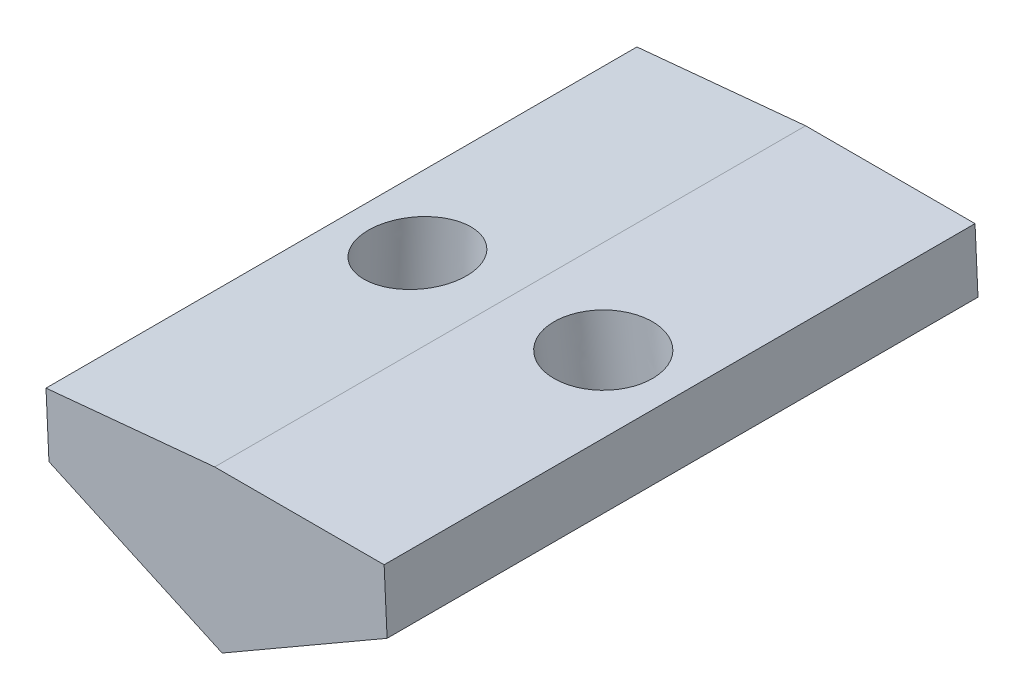
ISO-10303-21;
HEADER;
FILE_DESCRIPTION(('STEP AP214'),'2;1');
FILE_NAME('part.step','',(''),(''),'','','');
FILE_SCHEMA(('AUTOMOTIVE_DESIGN { 1 0 10303 214 1 1 1 1 }'));
ENDSEC;
DATA;
#1=APPLICATION_CONTEXT('core data for automotive mechanical design processes');
#2=APPLICATION_PROTOCOL_DEFINITION('international standard','automotive_design',2000,#1);
#3=PRODUCT_CONTEXT('',#1,'mechanical');
#4=PRODUCT('Part','Part','',(#3));
#5=PRODUCT_RELATED_PRODUCT_CATEGORY('part','',(#4));
#6=PRODUCT_DEFINITION_FORMATION('','',#4);
#7=PRODUCT_DEFINITION_CONTEXT('part definition',#1,'design');
#8=PRODUCT_DEFINITION('design','',#6,#7);
#9=PRODUCT_DEFINITION_SHAPE('','',#8);
#10=(LENGTH_UNIT() NAMED_UNIT(*) SI_UNIT(.MILLI.,.METRE.));
#11=(NAMED_UNIT(*) PLANE_ANGLE_UNIT() SI_UNIT($,.RADIAN.));
#12=(NAMED_UNIT(*) SI_UNIT($,.STERADIAN.) SOLID_ANGLE_UNIT());
#13=UNCERTAINTY_MEASURE_WITH_UNIT(LENGTH_MEASURE(1.E-05),#10,'distance_accuracy_value','');
#14=(GEOMETRIC_REPRESENTATION_CONTEXT(3) GLOBAL_UNCERTAINTY_ASSIGNED_CONTEXT((#13)) GLOBAL_UNIT_ASSIGNED_CONTEXT((#10,
#11,#12)) REPRESENTATION_CONTEXT('',''));
#15=CARTESIAN_POINT('',(0.,0.,0.));
#16=DIRECTION('',(0.,0.,1.));
#17=DIRECTION('',(1.,0.,0.));
#18=AXIS2_PLACEMENT_3D('',#15,#16,#17);
#19=CARTESIAN_POINT('',(-14.8505189803819,-1.98807355539718,7.5));
#20=DIRECTION('',(-0.415579185059123,-0.909557002581804,0.));
#21=DIRECTION('',(-0.909557002581804,0.415579185059123,0.));
#22=AXIS2_PLACEMENT_3D('',#19,#20,#21);
#23=PLANE('',#22);
#24=DIRECTION('',(0.909557002581804,-0.415579185059123,0.));
#25=VECTOR('',#24,1.);
#26=CARTESIAN_POINT('',(-14.8505189803819,-1.98807355539718,-7.5));
#27=LINE('',#26,#25);
#28=CARTESIAN_POINT('',(-14.8505189803819,-1.98807355539718,-7.5));
#29=VERTEX_POINT('',#28);
#30=CARTESIAN_POINT('',(-10.4534735725903,-3.99709612578153,-7.5));
#31=VERTEX_POINT('',#30);
#32=EDGE_CURVE('E107',#29,#31,#27,.T.);
#33=ORIENTED_EDGE('',*,*,#32,.T.);
#34=DIRECTION('',(0.,0.,-1.));
#35=VECTOR('',#34,1.);
#36=CARTESIAN_POINT('',(-10.4534735725903,-3.99709612578153,7.5));
#37=LINE('',#36,#35);
#38=CARTESIAN_POINT('',(-10.4534735725903,-3.99709612578153,7.5));
#39=VERTEX_POINT('',#38);
#40=EDGE_CURVE('E72',#39,#31,#37,.T.);
#41=ORIENTED_EDGE('',*,*,#40,.F.);
#42=DIRECTION('',(0.909557002581804,-0.415579185059123,0.));
#43=VECTOR('',#42,1.);
#44=CARTESIAN_POINT('',(-14.8505189803819,-1.98807355539718,7.5));
#45=LINE('',#44,#43);
#46=CARTESIAN_POINT('',(-14.8505189803819,-1.98807355539718,7.5));
#47=VERTEX_POINT('',#46);
#48=EDGE_CURVE('E122',#47,#39,#45,.T.);
#49=ORIENTED_EDGE('',*,*,#48,.F.);
#50=DIRECTION('',(0.,0.,-1.));
#51=VECTOR('',#50,1.);
#52=CARTESIAN_POINT('',(-14.8505189803819,-1.98807355539718,7.5));
#53=LINE('',#52,#51);
#54=EDGE_CURVE('E117',#47,#29,#53,.T.);
#55=ORIENTED_EDGE('',*,*,#54,.T.);
#56=EDGE_LOOP('',(#33,#41,#49,#55));
#57=FACE_BOUND('',#56,.T.);
#58=CARTESIAN_POINT('',(-14.289039690057,-2.24461504233912,0.));
#59=CARTESIAN_POINT('',(-14.289036375968,-2.24461655655582,0.0663782985745414));
#60=CARTESIAN_POINT('',(-14.2838261669421,-2.24699711589937,0.132821871776647));
#61=CARTESIAN_POINT('',(-14.2631677026734,-2.25643602706268,0.263798459380908));
#62=CARTESIAN_POINT('',(-14.2477113669509,-2.26349807087671,0.328329923826298));
#63=CARTESIAN_POINT('',(-14.2175080195199,-2.27729806634239,0.421777301564136));
#64=CARTESIAN_POINT('',(-14.206376599103,-2.28238404403512,0.452158199993047));
#65=CARTESIAN_POINT('',(-14.1819021127103,-2.29356650657562,0.511808067830465));
#66=CARTESIAN_POINT('',(-14.1685599961475,-2.29966255763388,0.541077507965336));
#67=CARTESIAN_POINT('',(-14.1250233400068,-2.31955457982471,0.627670823055269));
#68=CARTESIAN_POINT('',(-14.0915562404437,-2.33484579293532,0.6830491829234));
#69=CARTESIAN_POINT('',(-14.0171042904018,-2.36886310096176,0.787332027136946));
#70=CARTESIAN_POINT('',(-13.9761151281388,-2.38759116594405,0.836232770569979));
#71=CARTESIAN_POINT('',(-13.9088150211308,-2.41834077651865,0.905170853029055));
#72=CARTESIAN_POINT('',(-13.884746503528,-2.42933775076282,0.927909405199854));
#73=CARTESIAN_POINT('',(-13.835066126739,-2.45203685641628,0.971228252570491));
#74=CARTESIAN_POINT('',(-13.8094547532324,-2.46373876591716,0.991809221428911));
#75=CARTESIAN_POINT('',(-13.7299729405941,-2.50005423248987,1.05062323897325));
#76=CARTESIAN_POINT('',(-13.6739562767643,-2.52564840573911,1.08541656994461));
#77=CARTESIAN_POINT('',(-13.5577634833811,-2.57873722397352,1.14530154358398));
#78=CARTESIAN_POINT('',(-13.4975846322349,-2.60623311246224,1.17038676620097));
#79=CARTESIAN_POINT('',(-13.4024531664007,-2.64969895015318,1.20141886925401));
#80=CARTESIAN_POINT('',(-13.3684201297413,-2.66524874153501,1.21088797205526));
#81=CARTESIAN_POINT('',(-13.2998070407923,-2.69659825729805,1.22679083145963));
#82=CARTESIAN_POINT('',(-13.265227518906,-2.71239773933649,1.23322736436442));
#83=CARTESIAN_POINT('',(-13.1609386920822,-2.76004760134535,1.24796137869267));
#84=CARTESIAN_POINT('',(-13.0906503127294,-2.7921625620654,1.25169260332212));
#85=CARTESIAN_POINT('',(-12.9504521714035,-2.85621949214636,1.24689483806023));
#86=CARTESIAN_POINT('',(-12.8805424103246,-2.88816146109868,1.23836581922353));
#87=CARTESIAN_POINT('',(-12.7428300807612,-2.95108261670532,1.2091643082101));
#88=CARTESIAN_POINT('',(-12.6750276852813,-2.9820617243133,1.1884908217882));
#89=CARTESIAN_POINT('',(-12.5433598553786,-3.04222113080918,1.13528037596331));
#90=CARTESIAN_POINT('',(-12.4794950555298,-3.07140113975834,1.10274151017425));
#91=CARTESIAN_POINT('',(-12.359561885572,-3.12619894670302,1.02755882887577));
#92=CARTESIAN_POINT('',(-12.3033098873702,-3.15190064489707,0.985270183443642));
#93=CARTESIAN_POINT('',(-12.2000126492742,-3.19909744719201,0.892606887244238));
#94=CARTESIAN_POINT('',(-12.1527043640526,-3.22071273745214,0.84258798954573));
#95=CARTESIAN_POINT('',(-12.0679864678787,-3.2594205855056,0.736455551568861));
#96=CARTESIAN_POINT('',(-12.0302801504988,-3.27664870931072,0.680628738466095));
#97=CARTESIAN_POINT('',(-11.9649962416374,-3.30647711320964,0.564626374267814));
#98=CARTESIAN_POINT('',(-11.9371336190529,-3.31920762482619,0.504646660208818));
#99=CARTESIAN_POINT('',(-11.9028023867905,-3.33489366262824,0.41229613149207));
#100=CARTESIAN_POINT('',(-11.8926846979882,-3.33951646345897,0.38151589544725));
#101=CARTESIAN_POINT('',(-11.8747958584224,-3.34768992520714,0.319108263894572));
#102=CARTESIAN_POINT('',(-11.8670270073482,-3.35123953539005,0.287480070936075));
#103=CARTESIAN_POINT('',(-11.8474041821748,-3.36020526010106,0.191753738958296));
#104=CARTESIAN_POINT('',(-11.8391937167991,-3.36395664511607,0.126705863732532));
#105=CARTESIAN_POINT('',(-11.8328887894575,-3.36683738437597,-0.00396668778176826));
#106=CARTESIAN_POINT('',(-11.8347917028613,-3.36596793782198,-0.0695912100052314));
#107=CARTESIAN_POINT('',(-11.8450833051414,-3.36126567542787,-0.166480553473452));
#108=CARTESIAN_POINT('',(-11.8496896457086,-3.35916102530302,-0.198278196391107));
#109=CARTESIAN_POINT('',(-11.8612707223847,-3.35386959838476,-0.261344025826761));
#110=CARTESIAN_POINT('',(-11.8682451735034,-3.35068295180421,-0.292612275579427));
#111=CARTESIAN_POINT('',(-11.8928475975313,-3.3394420341937,-0.386116705750519));
#112=CARTESIAN_POINT('',(-11.9140688209421,-3.32974599677526,-0.447252207521547));
#113=CARTESIAN_POINT('',(-11.9652309892809,-3.30636985634293,-0.564947345862166));
#114=CARTESIAN_POINT('',(-11.9951756034567,-3.29268807683929,-0.621505044089941));
#115=CARTESIAN_POINT('',(-12.0462471684699,-3.26935333332338,-0.702573974040543));
#116=CARTESIAN_POINT('',(-12.0645638147236,-3.26098440548057,-0.729275189064333));
#117=CARTESIAN_POINT('',(-12.1030548289477,-3.24339775145197,-0.780991462976004));
#118=CARTESIAN_POINT('',(-12.1232285710982,-3.23418031120515,-0.806007085003328));
#119=CARTESIAN_POINT('',(-12.1867901406342,-3.20513884904974,-0.878887085423939));
#120=CARTESIAN_POINT('',(-12.2328425307092,-3.18409738085897,-0.92399161433926));
#121=CARTESIAN_POINT('',(-12.3306487753453,-3.13940942911517,-1.00601851486903));
#122=CARTESIAN_POINT('',(-12.3824066875117,-3.1157610916307,-1.04293500644915));
#123=CARTESIAN_POINT('',(-12.4657462934547,-3.0776829883094,-1.09322226753006));
#124=CARTESIAN_POINT('',(-12.4958230741014,-3.06394082156788,-1.10967491163987));
#125=CARTESIAN_POINT('',(-12.5570351826692,-3.03597283482031,-1.13990043394227));
#126=CARTESIAN_POINT('',(-12.5881695008624,-3.02174747616179,-1.15367578834126));
#127=CARTESIAN_POINT('',(-12.6829049098453,-2.97846259797429,-1.1909289238209));
#128=CARTESIAN_POINT('',(-12.7478669168458,-2.94878127195243,-1.21035082736061));
#129=CARTESIAN_POINT('',(-12.8796817615393,-2.88855469397997,-1.23806093139692));
#130=CARTESIAN_POINT('',(-12.9465344218122,-2.85800952309306,-1.24635017307221));
#131=CARTESIAN_POINT('',(-13.080615813133,-2.79674735351104,-1.25171887878022));
#132=CARTESIAN_POINT('',(-13.1478445339626,-2.76603035948465,-1.2487986459302));
#133=CARTESIAN_POINT('',(-13.2811259235373,-2.70513371297897,-1.23177759786365));
#134=CARTESIAN_POINT('',(-13.3471785456746,-2.67495408179486,-1.21767634055757));
#135=CARTESIAN_POINT('',(-13.4765413786905,-2.61584783494161,-1.17846290423805));
#136=CARTESIAN_POINT('',(-13.5398512982285,-2.58692135238683,-1.1533495586134));
#137=CARTESIAN_POINT('',(-13.6621031924466,-2.53106411372352,-1.09245111059459));
#138=CARTESIAN_POINT('',(-13.7210444181727,-2.50413369981421,-1.05666418361693));
#139=CARTESIAN_POINT('',(-13.8326959803471,-2.45311978305328,-0.975116357635609));
#140=CARTESIAN_POINT('',(-13.8854237827515,-2.42902829995657,-0.929384497570156));
#141=CARTESIAN_POINT('',(-13.9812795954878,-2.38523150610301,-0.830687510450994));
#142=CARTESIAN_POINT('',(-14.0246947959184,-2.36539497737205,-0.778060492778119));
#143=CARTESIAN_POINT('',(-14.1014870562068,-2.33030837492833,-0.667464474848252));
#144=CARTESIAN_POINT('',(-14.1351614830681,-2.31492243338468,-0.609745902027413));
#145=CARTESIAN_POINT('',(-14.1923601797056,-2.288788185979,-0.49066205745913));
#146=CARTESIAN_POINT('',(-14.2161523675654,-2.27791746758149,-0.429452693217399));
#147=CARTESIAN_POINT('',(-14.2526462315232,-2.26124331719822,-0.308228437378324));
#148=CARTESIAN_POINT('',(-14.2660474384406,-2.25512026758867,-0.248469937617148));
#149=CARTESIAN_POINT('',(-14.2797086947808,-2.24887840065716,-0.157013696364172));
#150=CARTESIAN_POINT('',(-14.2831902303876,-2.2472876771224,-0.125863131195248));
#151=CARTESIAN_POINT('',(-14.2878641989446,-2.24515212757638,-0.0631475549275867));
#152=CARTESIAN_POINT('',(-14.2890412668193,-2.24461432191197,-0.0315811653207291));
#153=CARTESIAN_POINT('',(-14.289039690057,-2.24461504233912,0.));
#154=B_SPLINE_CURVE_WITH_KNOTS('',3,(#58,#59,#60,#61,#62,#63,#64,#65,#66,#67,#68,#69,#70,#71,
#72,#73,#74,#75,#76,#77,#78,#79,#80,#81,#82,#83,#84,#85,#86,#87,#88,#89,#90,#91,#92,#93,#94,#95,
#96,#97,#98,#99,#100,#101,#102,#103,#104,#105,#106,#107,#108,#109,#110,#111,#112,#113,#114,#115,
#116,#117,#118,#119,#120,#121,#122,#123,#124,#125,#126,#127,#128,#129,#130,#131,#132,#133,#134,
#135,#136,#137,#138,#139,#140,#141,#142,#143,#144,#145,#146,#147,#148,#149,#150,#151,#152,#153),
.UNSPECIFIED.,.T.,.F.,(4,2,2,2,2,2,2,2,2,2,2,2,2,2,2,2,2,2,2,2,2,2,2,2,2,2,2,2,2,2,2,2,2,2,2,2,
2,2,2,2,2,2,2,2,2,2,2,4),(0.,0.199018913833737,0.398194968468036,0.496359711116183,
0.594482404357344,0.79302739484204,0.991686552476848,1.09625837626465,1.20079745191192,
1.41210542046451,1.62355289087992,1.73923038489,1.85480176999455,2.08584659927705,
2.31689197403699,2.54795626669241,2.77905770034088,3.00279249479485,3.21827549177727,
3.42594571343107,3.62698331914807,3.72507175847922,3.82325592508802,4.01927862844559,
4.21525046235212,4.31175006010901,4.40823804873484,4.60360176492279,4.79904777427686,
4.89928687351483,4.99949231612345,5.20204696800678,5.40474661184873,5.51544494054762,
5.62604039275902,5.84712556911769,6.06819006711453,6.28924858731186,6.5103158484378,
6.73140653490023,6.95253503714699,7.17302631857153,7.38519647263605,7.58996442996936,
7.78874701532292,7.97257929502029,8.06664254893988,8.16133086356538),.UNSPECIFIED.);
#155=CARTESIAN_POINT('',(-14.289039690057,-2.24461504233912,0.));
#156=VERTEX_POINT('',#155);
#157=EDGE_CURVE('E176',#156,#156,#154,.T.);
#158=ORIENTED_EDGE('',*,*,#157,.T.);
#159=EDGE_LOOP('',(#158));
#160=FACE_BOUND('',#159,.T.);
#161=ADVANCED_FACE('F38',(#57,#160),#23,.T.);
#162=CARTESIAN_POINT('',(-10.6435171949677,0.,7.5));
#163=DIRECTION('',(-0.094876369745652,0.995489062955433,0.));
#164=DIRECTION('',(0.995489062955433,0.094876369745652,0.));
#165=AXIS2_PLACEMENT_3D('',#162,#163,#164);
#166=PLANE('',#165);
#167=DIRECTION('',(-0.995489062955433,-0.094876369745652,0.));
#168=VECTOR('',#167,1.);
#169=CARTESIAN_POINT('',(-10.6435171949677,0.,-7.5));
#170=LINE('',#169,#168);
#171=CARTESIAN_POINT('',(-10.6435171949677,0.,-7.5));
#172=VERTEX_POINT('',#171);
#173=CARTESIAN_POINT('',(-14.9256460133394,-0.408113812786843,-7.5));
#174=VERTEX_POINT('',#173);
#175=EDGE_CURVE('E114',#172,#174,#170,.T.);
#176=ORIENTED_EDGE('',*,*,#175,.T.);
#177=DIRECTION('',(0.,0.,-1.));
#178=VECTOR('',#177,1.);
#179=CARTESIAN_POINT('',(-14.9256460133394,-0.408113812786843,7.5));
#180=LINE('',#179,#178);
#181=CARTESIAN_POINT('',(-14.9256460133394,-0.408113812786843,7.5));
#182=VERTEX_POINT('',#181);
#183=EDGE_CURVE('E110',#182,#174,#180,.T.);
#184=ORIENTED_EDGE('',*,*,#183,.F.);
#185=DIRECTION('',(-0.995489062955433,-0.094876369745652,0.));
#186=VECTOR('',#185,1.);
#187=CARTESIAN_POINT('',(-10.6435171949677,0.,7.5));
#188=LINE('',#187,#186);
#189=CARTESIAN_POINT('',(-10.6435171949677,0.,7.5));
#190=VERTEX_POINT('',#189);
#191=EDGE_CURVE('E98',#190,#182,#188,.T.);
#192=ORIENTED_EDGE('',*,*,#191,.F.);
#193=DIRECTION('',(0.,0.,-1.));
#194=VECTOR('',#193,1.);
#195=CARTESIAN_POINT('',(-10.6435171949677,0.,7.5));
#196=LINE('',#195,#194);
#197=EDGE_CURVE('E80',#190,#172,#196,.T.);
#198=ORIENTED_EDGE('',*,*,#197,.T.);
#199=EDGE_LOOP('',(#176,#184,#192,#198));
#200=FACE_BOUND('',#199,.T.);
#201=CARTESIAN_POINT('',(-14.2410978489657,-0.342872066625405,0.));
#202=CARTESIAN_POINT('',(-14.2410944818184,-0.342871745715087,0.0692358626819135));
#203=CARTESIAN_POINT('',(-14.2353503416949,-0.342324293028254,0.138544405837956));
#204=CARTESIAN_POINT('',(-14.2125242295172,-0.340148820951845,0.275211754098849));
#205=CARTESIAN_POINT('',(-14.1954422591119,-0.338520801719427,0.342570559487267));
#206=CARTESIAN_POINT('',(-14.1504155837906,-0.334229476324524,0.473529755417845));
#207=CARTESIAN_POINT('',(-14.1224708789307,-0.331566170167402,0.537130145979473));
#208=CARTESIAN_POINT('',(-14.0564884399864,-0.32527762867864,0.658805162167844));
#209=CARTESIAN_POINT('',(-14.0184507059757,-0.321652393354039,0.716879787835019));
#210=CARTESIAN_POINT('',(-13.9333316323066,-0.3135400101985,0.825905040356854));
#211=CARTESIAN_POINT('',(-13.8862502927263,-0.309052862375019,0.876855667273154));
#212=CARTESIAN_POINT('',(-13.7843425024721,-0.299340408920826,0.970226708469671));
#213=CARTESIAN_POINT('',(-13.7295160518683,-0.294115103296787,1.012647122827));
#214=CARTESIAN_POINT('',(-13.6136302434667,-0.283070456785506,1.08778800206828));
#215=CARTESIAN_POINT('',(-13.5525708857214,-0.277251115903278,1.12050846703407));
#216=CARTESIAN_POINT('',(-13.425903344459,-0.265178902428713,1.17534692644399));
#217=CARTESIAN_POINT('',(-13.3602951609731,-0.258926029839372,1.19746492096137));
#218=CARTESIAN_POINT('',(-13.2263395113012,-0.246159213788109,1.23048843042266));
#219=CARTESIAN_POINT('',(-13.1579920451277,-0.239645270327394,1.24139394541842));
#220=CARTESIAN_POINT('',(-13.0204429188519,-0.226535973351305,1.25169171124794));
#221=CARTESIAN_POINT('',(-12.9512412587512,-0.219940619836081,1.25108396210281));
#222=CARTESIAN_POINT('',(-12.8138923918439,-0.206850408837525,1.23837196303159));
#223=CARTESIAN_POINT('',(-12.7457451850386,-0.20035555135431,1.22626771309218));
#224=CARTESIAN_POINT('',(-12.6123847908199,-0.187645466892155,1.19089655368163));
#225=CARTESIAN_POINT('',(-12.5471716034184,-0.181430239914339,1.16762964416558));
#226=CARTESIAN_POINT('',(-12.4214778957895,-0.169450838910884,1.11057488097867));
#227=CARTESIAN_POINT('',(-12.3609973755927,-0.163686664888153,1.07678702723998));
#228=CARTESIAN_POINT('',(-12.246437124959,-0.152768352370476,0.999622268521558));
#229=CARTESIAN_POINT('',(-12.1923573945744,-0.147614213880511,0.956245363463534));
#230=CARTESIAN_POINT('',(-12.0920903123887,-0.138058130225979,0.861098873798068));
#231=CARTESIAN_POINT('',(-12.0459029606585,-0.133656185068174,0.809329289115186));
#232=CARTESIAN_POINT('',(-11.9626945494446,-0.125725900063499,0.698825296714459));
#233=CARTESIAN_POINT('',(-11.9256734900419,-0.122197560224342,0.640090888935133));
#234=CARTESIAN_POINT('',(-11.8618187628964,-0.116111803054216,0.517277211959699));
#235=CARTESIAN_POINT('',(-11.8349850952321,-0.113554385730722,0.453197942722444));
#236=CARTESIAN_POINT('',(-11.7922452712066,-0.109481011649581,0.321461933665315));
#237=CARTESIAN_POINT('',(-11.7763391142282,-0.107965054833097,0.253805194047546));
#238=CARTESIAN_POINT('',(-11.7558930330646,-0.106016414683735,0.116780330417331));
#239=CARTESIAN_POINT('',(-11.7513531045745,-0.105583730940569,0.0474122070530809));
#240=CARTESIAN_POINT('',(-11.7537646872583,-0.1058135699402,-0.0911221816600625));
#241=CARTESIAN_POINT('',(-11.7607161984342,-0.1064760926832,-0.160288447008918));
#242=CARTESIAN_POINT('',(-11.7859189252829,-0.108878071087664,-0.296511420127748));
#243=CARTESIAN_POINT('',(-11.8041701409243,-0.110617526746136,-0.363568127903583));
#244=CARTESIAN_POINT('',(-11.8514688762347,-0.115125393750205,-0.493722474367876));
#245=CARTESIAN_POINT('',(-11.8805163958449,-0.117893805090209,-0.556820113077857));
#246=CARTESIAN_POINT('',(-11.9486065604006,-0.124383226088212,-0.677316012191557));
#247=CARTESIAN_POINT('',(-11.9876492052711,-0.128104235739068,-0.734714272638012));
#248=CARTESIAN_POINT('',(-12.0746527644833,-0.13639622222107,-0.842228309051984));
#249=CARTESIAN_POINT('',(-12.1226136787471,-0.140967199044788,-0.892344085083145));
#250=CARTESIAN_POINT('',(-12.2261309483045,-0.150833046000883,-0.983910912570453));
#251=CARTESIAN_POINT('',(-12.2816873035295,-0.156127916126727,-1.02536196410478));
#252=CARTESIAN_POINT('',(-12.3988631419393,-0.167295510612614,-1.09845608982839));
#253=CARTESIAN_POINT('',(-12.4604826250736,-0.173168234967851,-1.13009916409926));
#254=CARTESIAN_POINT('',(-12.5880851858293,-0.185329561681784,-1.18270459852465));
#255=CARTESIAN_POINT('',(-12.6540682634214,-0.191618164037694,-1.20366695875074));
#256=CARTESIAN_POINT('',(-12.7885781337585,-0.204437800804629,-1.2343328115842));
#257=CARTESIAN_POINT('',(-12.8571049264925,-0.2109688352146,-1.24403630424056));
#258=CARTESIAN_POINT('',(-12.9948121938735,-0.224093204032797,-1.2519167950458));
#259=CARTESIAN_POINT('',(-13.0639926685196,-0.230686538440929,-1.25009379321224));
#260=CARTESIAN_POINT('',(-13.2010992388503,-0.243753657051585,-1.23497157381143));
#261=CARTESIAN_POINT('',(-13.269025334533,-0.250227441253933,-1.22167235622728));
#262=CARTESIAN_POINT('',(-13.4017496795478,-0.262876906225941,-1.18396450648421));
#263=CARTESIAN_POINT('',(-13.4665479288664,-0.269052586994316,-1.15955587427746));
#264=CARTESIAN_POINT('',(-13.5912293824965,-0.280935513824183,-1.10030239222836));
#265=CARTESIAN_POINT('',(-13.6511125867752,-0.286642759882553,-1.06545754231645));
#266=CARTESIAN_POINT('',(-13.7643122890411,-0.297431403582356,-0.986292697665745));
#267=CARTESIAN_POINT('',(-13.8176287869738,-0.302512801218598,-0.941972702848335));
#268=CARTESIAN_POINT('',(-13.9162245914832,-0.311909601597537,-0.845079848038767));
#269=CARTESIAN_POINT('',(-13.9615038979875,-0.316225004333327,-0.792506987972179));
#270=CARTESIAN_POINT('',(-14.0427762562685,-0.323970771314907,-0.680558797629225));
#271=CARTESIAN_POINT('',(-14.0787693079639,-0.327401135552951,-0.621183467293319));
#272=CARTESIAN_POINT('',(-14.1404771405686,-0.33328228016847,-0.497266542456667));
#273=CARTESIAN_POINT('',(-14.1661919214005,-0.33573306053857,-0.432724947917031));
#274=CARTESIAN_POINT('',(-14.204308110304,-0.339365773107975,-0.307870659100866));
#275=CARTESIAN_POINT('',(-14.217899696314,-0.340661136751533,-0.247924083108697));
#276=CARTESIAN_POINT('',(-14.231707772208,-0.341977133242857,-0.156433524947284));
#277=CARTESIAN_POINT('',(-14.235214711017,-0.342311366571471,-0.125361012415935));
#278=CARTESIAN_POINT('',(-14.2399171342818,-0.342759537088838,-0.0628646576544196));
#279=CARTESIAN_POINT('',(-14.2410993779784,-0.342872212349932,-0.0314398223443878));
#280=CARTESIAN_POINT('',(-14.2410978489657,-0.342872066625405,0.));
#281=B_SPLINE_CURVE_WITH_KNOTS('',3,(#201,#202,#203,#204,#205,#206,#207,#208,#209,#210,#211,
#212,#213,#214,#215,#216,#217,#218,#219,#220,#221,#222,#223,#224,#225,#226,#227,#228,#229,#230,
#231,#232,#233,#234,#235,#236,#237,#238,#239,#240,#241,#242,#243,#244,#245,#246,#247,#248,#249,
#250,#251,#252,#253,#254,#255,#256,#257,#258,#259,#260,#261,#262,#263,#264,#265,#266,#267,#268,
#269,#270,#271,#272,#273,#274,#275,#276,#277,#278,#279,#280),.UNSPECIFIED.,.T.,.F.,(4,2,2,2,2,2,
2,2,2,2,2,2,2,2,2,2,2,2,2,2,2,2,2,2,2,2,2,2,2,2,2,2,2,2,2,2,2,2,2,4),(0.,0.207595043011116,
0.415190055829751,0.622785067573066,0.830380077797412,1.03797508622557,1.24557009277712,
1.45316509757725,1.66076010094304,1.86835510334871,2.07595010537367,2.28354510763907,
2.49114011073969,2.69873511517879,2.90633012131302,3.11392512931328,3.32152013914604,
3.52911515057699,3.73671015028008,3.94430507135664,4.1518999924715,4.35949491300967,
4.56708983241936,4.7746847502724,4.98227966631121,5.18987458047695,5.39746949291604,
5.60506440396403,5.81265931410892,6.02025422393763,6.22784913407173,6.43544404509933,
6.64303895751065,6.85063387164431,7.05822878765021,7.26582370547314,7.47341862485881,
7.65716205990829,7.7508980576219,7.8451664182521),.UNSPECIFIED.);
#282=CARTESIAN_POINT('',(-14.2410978489657,-0.342872066625405,0.));
#283=VERTEX_POINT('',#282);
#284=EDGE_CURVE('E185',#283,#283,#281,.T.);
#285=ORIENTED_EDGE('',*,*,#284,.F.);
#286=EDGE_LOOP('',(#285));
#287=FACE_BOUND('',#286,.T.);
#288=ADVANCED_FACE('F111',(#200,#287),#166,.T.);
#289=CARTESIAN_POINT('',(-6.26687172803054,-1.57996042383524,7.5));
#290=DIRECTION('',(0.499999999999987,-0.866025403784446,0.));
#291=DIRECTION('',(0.866025403784446,0.499999999999987,0.));
#292=AXIS2_PLACEMENT_3D('',#289,#290,#291);
#293=PLANE('',#292);
#294=DIRECTION('',(-0.866025403784446,-0.499999999999987,0.));
#295=VECTOR('',#294,1.);
#296=CARTESIAN_POINT('',(-6.26687172803054,-1.57996042383524,-7.5));
#297=LINE('',#296,#295);
#298=CARTESIAN_POINT('',(-6.26687172803054,-1.57996042383524,-7.5));
#299=VERTEX_POINT('',#298);
#300=EDGE_CURVE('E139',#299,#31,#297,.T.);
#301=ORIENTED_EDGE('',*,*,#300,.F.);
#302=DIRECTION('',(0.,0.,-1.));
#303=VECTOR('',#302,1.);
#304=CARTESIAN_POINT('',(-6.26687172803054,-1.57996042383524,7.5));
#305=LINE('',#304,#303);
#306=CARTESIAN_POINT('',(-6.26687172803054,-1.57996042383524,7.5));
#307=VERTEX_POINT('',#306);
#308=EDGE_CURVE('E11',#307,#299,#305,.T.);
#309=ORIENTED_EDGE('',*,*,#308,.F.);
#310=DIRECTION('',(-0.866025403784446,-0.499999999999987,0.));
#311=VECTOR('',#310,1.);
#312=CARTESIAN_POINT('',(-6.26687172803054,-1.57996042383524,7.5));
#313=LINE('',#312,#311);
#314=EDGE_CURVE('E55',#307,#39,#313,.T.);
#315=ORIENTED_EDGE('',*,*,#314,.T.);
#316=ORIENTED_EDGE('',*,*,#40,.T.);
#317=EDGE_LOOP('',(#301,#309,#315,#316));
#318=FACE_BOUND('',#317,.T.);
#319=CARTESIAN_POINT('',(-9.13855647447668,-3.2379283852236,0.));
#320=CARTESIAN_POINT('',(-9.13855330053664,-3.23792655274846,0.0664031444598509));
#321=CARTESIAN_POINT('',(-9.13358865105196,-3.23506021103205,0.132871948839943));
#322=CARTESIAN_POINT('',(-9.11391159989156,-3.22369966024774,0.263846406433579));
#323=CARTESIAN_POINT('',(-9.09919893877027,-3.21520530138886,0.328352007348218));
#324=CARTESIAN_POINT('',(-9.07044935539053,-3.19860672168548,0.421772480975602));
#325=CARTESIAN_POINT('',(-9.05985166788161,-3.19248814394942,0.452150837413798));
#326=CARTESIAN_POINT('',(-9.03654898460056,-3.17903433348427,0.51180054912965));
#327=CARTESIAN_POINT('',(-9.02384455719461,-3.17169942890154,0.541072200370953));
#328=CARTESIAN_POINT('',(-8.98239008501426,-3.14776567822909,0.627668590552461));
#329=CARTESIAN_POINT('',(-8.95052410911981,-3.12936784846842,0.683047818143838));
#330=CARTESIAN_POINT('',(-8.87963558454408,-3.08844033972223,0.787329821835831));
#331=CARTESIAN_POINT('',(-8.84060924932574,-3.06590847457853,0.836229147563132));
#332=CARTESIAN_POINT('',(-8.77653151133897,-3.02891317530276,0.905165989293868));
#333=CARTESIAN_POINT('',(-8.7536150522447,-3.01568235147576,0.927904500930129));
#334=CARTESIAN_POINT('',(-8.70631247287795,-2.98837219454496,0.971223481571515));
#335=CARTESIAN_POINT('',(-8.68192680258792,-2.97429312123866,0.991804606092093));
#336=CARTESIAN_POINT('',(-8.60624898147913,-2.93060051084983,1.05061895707605));
#337=CARTESIAN_POINT('',(-8.55291333257692,-2.89980715959872,1.08541249614508));
#338=CARTESIAN_POINT('',(-8.44228175580297,-2.83593398896743,1.14529792032574));
#339=CARTESIAN_POINT('',(-8.38498324442137,-2.80285267799713,1.1703834048337));
#340=CARTESIAN_POINT('',(-8.29440470495491,-2.75055713385335,1.20141615259024));
#341=CARTESIAN_POINT('',(-8.262000240305,-2.73184840746476,1.21088555020413));
#342=CARTESIAN_POINT('',(-8.19667044874199,-2.69413023471974,1.22678898832562));
#343=CARTESIAN_POINT('',(-8.16374562670446,-2.67512107985336,1.23322580427392));
#344=CARTESIAN_POINT('',(-8.06444721894711,-2.61779111740456,1.24796064678936));
#345=CARTESIAN_POINT('',(-7.99752224751999,-2.57915196713561,1.25169239913987));
#346=CARTESIAN_POINT('',(-7.86403273067881,-2.50208175865336,1.24689563967948));
#347=CARTESIAN_POINT('',(-7.79746818611492,-2.46365070093091,1.23836709896152));
#348=CARTESIAN_POINT('',(-7.66634536557355,-2.38794690519445,1.20916647610518));
#349=CARTESIAN_POINT('',(-7.60178725432217,-2.3506742622851,1.18849339967129));
#350=CARTESIAN_POINT('',(-7.47641950171939,-2.27829315657217,1.13528366987424));
#351=CARTESIAN_POINT('',(-7.41561046460321,-2.24318504262398,1.10274510997378));
#352=CARTESIAN_POINT('',(-7.3014157022866,-2.17725466586041,1.02756290519838));
#353=CARTESIAN_POINT('',(-7.24785513541873,-2.14633145816129,0.985274442023723));
#354=CARTESIAN_POINT('',(-7.14950032496257,-2.08954628186831,0.892611499181224));
#355=CARTESIAN_POINT('',(-7.10445560206486,-2.06353969897774,0.842592812336494));
#356=CARTESIAN_POINT('',(-7.02379123714336,-2.01696810617631,0.736460844283201));
#357=CARTESIAN_POINT('',(-6.98788906238688,-1.99623997591616,0.680634322609165));
#358=CARTESIAN_POINT('',(-6.92572877251105,-1.96035171582345,0.564632615233623));
#359=CARTESIAN_POINT('',(-6.89919924149592,-1.94503488395039,0.504653289592588));
#360=CARTESIAN_POINT('',(-6.86651048740321,-1.92616202297554,0.412303352557294));
#361=CARTESIAN_POINT('',(-6.8568768388574,-1.92060003339436,0.381523357969075));
#362=CARTESIAN_POINT('',(-6.83984375703489,-1.91076597901902,0.319116190076079));
#363=CARTESIAN_POINT('',(-6.83244651336963,-1.9064951783976,0.287488219300865));
#364=CARTESIAN_POINT('',(-6.81376221130775,-1.89570779157253,0.191762641639723));
#365=CARTESIAN_POINT('',(-6.80594424546576,-1.89119408688917,0.126715270755784));
#366=CARTESIAN_POINT('',(-6.79994010339946,-1.88772759385096,-0.0039563680682391));
#367=CARTESIAN_POINT('',(-6.80175142806,-1.8887733626313,-0.0695804819110402));
#368=CARTESIAN_POINT('',(-6.81154967206118,-1.89443038144297,-0.166469278072372));
#369=CARTESIAN_POINT('',(-6.81593528125897,-1.89696241409388,-0.198266743080782));
#370=CARTESIAN_POINT('',(-6.82696153240195,-1.90332842315942,-0.261332242650706));
#371=CARTESIAN_POINT('',(-6.83360190298223,-1.90716224290144,-0.292600340447386));
#372=CARTESIAN_POINT('',(-6.85702598108138,-1.92068614069759,-0.386104348124554));
#373=CARTESIAN_POINT('',(-6.87723094914467,-1.93235148444815,-0.447239621354218));
#374=CARTESIAN_POINT('',(-6.92594324117862,-1.96047553936617,-0.564934427799638));
#375=CARTESIAN_POINT('',(-6.95445405900469,-1.97693626771199,-0.621492022595375));
#376=CARTESIAN_POINT('',(-7.00308036324736,-2.0050106775567,-0.702560955042495));
#377=CARTESIAN_POINT('',(-7.02052006270558,-2.01507949273399,-0.729262220051415));
#378=CARTESIAN_POINT('',(-7.05716826990814,-2.03623834502807,-0.780978627930369));
#379=CARTESIAN_POINT('',(-7.07637618174161,-2.04732803809557,-0.805994333969206));
#380=CARTESIAN_POINT('',(-7.1368947299108,-2.08226843817182,-0.87887463448846));
#381=CARTESIAN_POINT('',(-7.18074239723741,-2.10758390070628,-0.923979438954056));
#382=CARTESIAN_POINT('',(-7.2738663234323,-2.16134902456295,-1.00600707767065));
#383=CARTESIAN_POINT('',(-7.32314644590026,-2.18980091653548,-1.0429240317266));
#384=CARTESIAN_POINT('',(-7.40249666597163,-2.23561378745394,-1.09321232669005));
#385=CARTESIAN_POINT('',(-7.43113387764338,-2.25214748932148,-1.10966544471788));
#386=CARTESIAN_POINT('',(-7.48941621408364,-2.28579681195427,-1.13989193450968));
#387=CARTESIAN_POINT('',(-7.51906037742988,-2.30291187764212,-1.15366778244676));
#388=CARTESIAN_POINT('',(-7.60926159148189,-2.35498957285628,-1.19092243157543));
#389=CARTESIAN_POINT('',(-7.67111446644475,-2.39070034686623,-1.21034538915434));
#390=CARTESIAN_POINT('',(-7.79662067913867,-2.46316139255004,-1.23805770090527));
#391=CARTESIAN_POINT('',(-7.86027384790556,-2.49991156667237,-1.24634809639178));
#392=CARTESIAN_POINT('',(-7.98793841050431,-2.57361873625473,-1.25171920832629));
#393=CARTESIAN_POINT('',(-8.05194979459966,-2.61057572609338,-1.2488002279884));
#394=CARTESIAN_POINT('',(-8.17885298095899,-2.68384331489895,-1.23178176507942));
#395=CARTESIAN_POINT('',(-8.24174473885878,-2.72015388825221,-1.21768184047718));
#396=CARTESIAN_POINT('',(-8.36491731026563,-2.79126760551073,-1.17847111143459));
#397=CARTESIAN_POINT('',(-8.42519784639996,-2.82607058927479,-1.15335914039386));
#398=CARTESIAN_POINT('',(-8.54160026073016,-2.89327555452266,-1.09246342460029));
#399=CARTESIAN_POINT('',(-8.59772142583692,-2.92567712430428,-1.05667785520851));
#400=CARTESIAN_POINT('',(-8.7040317246939,-2.98705540396701,-0.975132332052509));
#401=CARTESIAN_POINT('',(-8.75423744380631,-3.01604168941144,-0.929401340721442));
#402=CARTESIAN_POINT('',(-8.84550839373026,-3.06873699691925,-0.830705938328169));
#403=CARTESIAN_POINT('',(-8.88684709356303,-3.09260390639565,-0.778079682238342));
#404=CARTESIAN_POINT('',(-8.95996666739991,-3.13481951203339,-0.667485099683322));
#405=CARTESIAN_POINT('',(-8.99203070401641,-3.15333169220522,-0.609767237069987));
#406=CARTESIAN_POINT('',(-9.04649433944926,-3.18477628678341,-0.490684720671005));
#407=CARTESIAN_POINT('',(-9.06914906325893,-3.19785599767333,-0.429476002246919));
#408=CARTESIAN_POINT('',(-9.10389986620439,-3.21791938310842,-0.308248975885651));
#409=CARTESIAN_POINT('',(-9.1166614690312,-3.22528729793576,-0.248486868980305));
#410=CARTESIAN_POINT('',(-9.12968324700305,-3.23280542495312,-0.156936753890962));
#411=CARTESIAN_POINT('',(-9.13300495117986,-3.23472321175377,-0.12569509237541));
#412=CARTESIAN_POINT('',(-9.13744339320966,-3.23728574745446,-0.0629740119896809));
#413=CARTESIAN_POINT('',(-9.13855797984679,-3.23792925434944,-0.0314943911478631));
#414=CARTESIAN_POINT('',(-9.13855647447668,-3.2379283852236,0.));
#415=B_SPLINE_CURVE_WITH_KNOTS('',3,(#319,#320,#321,#322,#323,#324,#325,#326,#327,#328,#329,
#330,#331,#332,#333,#334,#335,#336,#337,#338,#339,#340,#341,#342,#343,#344,#345,#346,#347,#348,
#349,#350,#351,#352,#353,#354,#355,#356,#357,#358,#359,#360,#361,#362,#363,#364,#365,#366,#367,
#368,#369,#370,#371,#372,#373,#374,#375,#376,#377,#378,#379,#380,#381,#382,#383,#384,#385,#386,
#387,#388,#389,#390,#391,#392,#393,#394,#395,#396,#397,#398,#399,#400,#401,#402,#403,#404,#405,
#406,#407,#408,#409,#410,#411,#412,#413,#414),.UNSPECIFIED.,.T.,.F.,(4,2,2,2,2,2,2,2,2,2,2,2,2,
2,2,2,2,2,2,2,2,2,2,2,2,2,2,2,2,2,2,2,2,2,2,2,2,2,2,2,2,2,2,2,2,2,2,4),(0.,0.199093737732046,
0.398192774602408,0.496349165582242,0.594479118424647,0.793027406656067,0.991680995296886,
1.09625238836964,1.20079191507859,1.41210006621055,1.62354729823297,1.73922587042434,
1.85479836609532,2.08584538128788,2.31689294123914,2.54795942011645,2.77906304295972,
3.00279981219163,3.21828392062462,3.42595445130437,3.62699168229002,3.72507966990448,
3.82326338445267,4.01928481254398,4.21525536916134,4.31175429283746,4.4082416067945,
4.60360394546016,4.79904858224151,4.89928715976825,4.99949207839049,5.20204562779791,
5.40474417560819,5.51544286628037,5.62603868073976,5.84712457843266,6.06818979481343,
6.28924903141232,6.51031700787593,6.73140840962318,6.95253762836581,7.17303131156584,
7.38520292938897,7.58997149256335,7.78875391459155,7.97259826535742,8.06693466355032,
8.16136296362894),.UNSPECIFIED.);
#416=CARTESIAN_POINT('',(-9.13855647447668,-3.2379283852236,0.));
#417=VERTEX_POINT('',#416);
#418=EDGE_CURVE('E129',#417,#417,#415,.T.);
#419=ORIENTED_EDGE('',*,*,#418,.T.);
#420=EDGE_LOOP('',(#419));
#421=FACE_BOUND('',#420,.T.);
#422=ADVANCED_FACE('F161',(#318,#421),#293,.T.);
#423=CARTESIAN_POINT('',(-10.6435171949677,0.,7.5));
#424=DIRECTION('',(0.,1.,0.));
#425=DIRECTION('',(-1.,0.,0.));
#426=AXIS2_PLACEMENT_3D('',#423,#424,#425);
#427=PLANE('',#426);
#428=DIRECTION('',(1.,0.,0.));
#429=VECTOR('',#428,1.);
#430=CARTESIAN_POINT('',(-10.6435171949677,0.,-7.5));
#431=LINE('',#430,#429);
#432=CARTESIAN_POINT('',(-6.34198443311221,0.,-7.5));
#433=VERTEX_POINT('',#432);
#434=EDGE_CURVE('E134',#172,#433,#431,.T.);
#435=ORIENTED_EDGE('',*,*,#434,.F.);
#436=ORIENTED_EDGE('',*,*,#197,.F.);
#437=DIRECTION('',(1.,0.,0.));
#438=VECTOR('',#437,1.);
#439=CARTESIAN_POINT('',(-10.6435171949677,0.,7.5));
#440=LINE('',#439,#438);
#441=CARTESIAN_POINT('',(-6.34198443311221,0.,7.5));
#442=VERTEX_POINT('',#441);
#443=EDGE_CURVE('E105',#190,#442,#440,.T.);
#444=ORIENTED_EDGE('',*,*,#443,.T.);
#445=DIRECTION('',(0.,0.,-1.));
#446=VECTOR('',#445,1.);
#447=CARTESIAN_POINT('',(-6.34198443311221,0.,7.5));
#448=LINE('',#447,#446);
#449=EDGE_CURVE('E42',#442,#433,#448,.T.);
#450=ORIENTED_EDGE('',*,*,#449,.T.);
#451=EDGE_LOOP('',(#435,#436,#444,#450));
#452=FACE_BOUND('',#451,.T.);
#453=CARTESIAN_POINT('',(-9.52964606627666,0.,0.));
#454=CARTESIAN_POINT('',(-9.52964268388428,0.,0.0692360953330542));
#455=CARTESIAN_POINT('',(-9.52387250210078,0.,0.138544873883137));
#456=CARTESIAN_POINT('',(-9.5009428990219,0.,0.275212698938108));
#457=CARTESIAN_POINT('',(-9.48378347770642,0.,0.342571745439554));
#458=CARTESIAN_POINT('',(-9.43855264359952,0.,0.473531381529538));
#459=CARTESIAN_POINT('',(-9.41048123589974,0.,0.537131972871794));
#460=CARTESIAN_POINT('',(-9.34419963281355,0.,0.658807319255779));
#461=CARTESIAN_POINT('',(-9.30598944527537,0.,0.716882078574905));
#462=CARTESIAN_POINT('',(-9.22048447589071,0.,0.825907511242328));
#463=CARTESIAN_POINT('',(-9.17318970217298,0.,0.87685819096506));
#464=CARTESIAN_POINT('',(-9.07081995539181,0.,0.970229241161079));
#465=CARTESIAN_POINT('',(-9.01574498946631,0.,1.01264961946039));
#466=CARTESIAN_POINT('',(-8.89933393092916,0.,1.08779032725842));
#467=CARTESIAN_POINT('',(-8.83799784357431,0.,1.12051066490115));
#468=CARTESIAN_POINT('',(-8.7107562694227,0.,1.17534877368688));
#469=CARTESIAN_POINT('',(-8.64485078568628,0.,1.19746655193085));
#470=CARTESIAN_POINT('',(-8.51028817324705,0.,1.23048954108951));
#471=CARTESIAN_POINT('',(-8.4416310457179,0.,1.24139475678656));
#472=CARTESIAN_POINT('',(-8.30345878481694,0.,1.25169184790828));
#473=CARTESIAN_POINT('',(-8.23394365156231,0.,1.25108372490524));
#474=CARTESIAN_POINT('',(-8.0959726921343,0.,1.23837091683867));
#475=CARTESIAN_POINT('',(-8.02751686596004,0.,1.22626623178464));
#476=CARTESIAN_POINT('',(-7.8935526243572,0.,1.19089416657438));
#477=CARTESIAN_POINT('',(-7.82804420892017,0.,1.16762678645017));
#478=CARTESIAN_POINT('',(-7.70178159553055,0.,1.11057108299155));
#479=CARTESIAN_POINT('',(-7.6410273975561,0.,1.07678275970552));
#480=CARTESIAN_POINT('',(-7.52594889355238,0.,0.999617103590824));
#481=CARTESIAN_POINT('',(-7.47162458748567,0.,0.95623977081801));
#482=CARTESIAN_POINT('',(-7.37090419223455,0.,0.86109250477263));
#483=CARTESIAN_POINT('',(-7.32450810299931,0.,0.80932257155387));
#484=CARTESIAN_POINT('',(-7.24092379238786,0.,0.698817988157114));
#485=CARTESIAN_POINT('',(-7.20373557095368,0.,0.640083338022965));
#486=CARTESIAN_POINT('',(-7.13959268084079,0.,0.517269294518967));
#487=CARTESIAN_POINT('',(-7.1126380121059,0.,0.453189901178463));
#488=CARTESIAN_POINT('',(-7.0697056592652,0.,0.321453754003181));
#489=CARTESIAN_POINT('',(-7.05372797511457,0.,0.253797000183012));
#490=CARTESIAN_POINT('',(-7.03319026806347,0.,0.116772178251996));
#491=CARTESIAN_POINT('',(-7.02863024513754,0.,0.0474041101449636));
#492=CARTESIAN_POINT('',(-7.03105362925035,0.,-0.0911300964243467));
#493=CARTESIAN_POINT('',(-7.03803703628757,0.,-0.160296234886652));
#494=CARTESIAN_POINT('',(-7.06335467281764,0.,-0.296518907420589));
#495=CARTESIAN_POINT('',(-7.08168890233298,0.,-0.363575441488042));
#496=CARTESIAN_POINT('',(-7.12920251163682,0.,-0.493729413058872));
#497=CARTESIAN_POINT('',(-7.15838189146735,0.,-0.5568268505469));
#498=CARTESIAN_POINT('',(-7.22678100965778,0.,-0.677322328691559));
#499=CARTESIAN_POINT('',(-7.26600074807136,0.,-0.73472036931771));
#500=CARTESIAN_POINT('',(-7.35339886664597,0.,-0.842233944221966));
#501=CARTESIAN_POINT('',(-7.40157724686284,0.,-0.892349478454678));
#502=CARTESIAN_POINT('',(-7.50556383963956,0.,-0.983915786475803));
#503=CARTESIAN_POINT('',(-7.56137205224852,0.,-1.02536656020846));
#504=CARTESIAN_POINT('',(-7.67907905592209,0.,-1.09846007457041));
#505=CARTESIAN_POINT('',(-7.74097784702283,0.,-1.13010281514152));
#506=CARTESIAN_POINT('',(-7.8691587628538,0.,-1.18270750735126));
#507=CARTESIAN_POINT('',(-7.93544088760497,0.,-1.20366945893884));
#508=CARTESIAN_POINT('',(-8.07056032327536,0.,-1.23433440844927));
#509=CARTESIAN_POINT('',(-8.13939763420251,0.,-1.24403740633718));
#510=CARTESIAN_POINT('',(-8.27772881615282,0.,-1.2519168236736));
#511=CARTESIAN_POINT('',(-8.34722268717669,0.,-1.25009324310959));
#512=CARTESIAN_POINT('',(-8.48495025393066,0.,-1.23496980039293));
#513=CARTESIAN_POINT('',(-8.55318394966208,0.,-1.22166993825233));
#514=CARTESIAN_POINT('',(-8.68650918806064,0.,-1.18396076659313));
#515=CARTESIAN_POINT('',(-8.75160073073743,0.,-1.15955145710865));
#516=CARTESIAN_POINT('',(-8.87684635842668,0.,-1.10029663123691));
#517=CARTESIAN_POINT('',(-8.93700044346263,0.,-1.06545111489927));
#518=CARTESIAN_POINT('',(-9.05071201973349,0.,-0.986284995301492));
#519=CARTESIAN_POINT('',(-9.10426951100745,0.,-0.941964392097416));
#520=CARTESIAN_POINT('',(-9.20331077760643,0.,-0.845070421005481));
#521=CARTESIAN_POINT('',(-9.24879455298337,0.,-0.792497053170705));
#522=CARTESIAN_POINT('',(-9.33043370356154,0.,-0.680547980218756));
#523=CARTESIAN_POINT('',(-9.366589078821,0.,-0.621172275144046));
#524=CARTESIAN_POINT('',(-9.42857496403652,0.,-0.497254746404323));
#525=CARTESIAN_POINT('',(-9.45440547404802,0.,-0.432712922767046));
#526=CARTESIAN_POINT('',(-9.4926923270712,0.,-0.307860240135453));
#527=CARTESIAN_POINT('',(-9.50634451757998,0.,-0.247915567947584));
#528=CARTESIAN_POINT('',(-9.5202141460451,0.,-0.156428037227276));
#529=CARTESIAN_POINT('',(-9.52373671344215,0.,-0.125356597536659));
#530=CARTESIAN_POINT('',(-9.52846009085217,0.,-0.0628624292984273));
#531=CARTESIAN_POINT('',(-9.5296476021525,0.,-0.0314387078675627));
#532=CARTESIAN_POINT('',(-9.52964606627666,0.,0.));
#533=B_SPLINE_CURVE_WITH_KNOTS('',3,(#453,#454,#455,#456,#457,#458,#459,#460,#461,#462,#463,
#464,#465,#466,#467,#468,#469,#470,#471,#472,#473,#474,#475,#476,#477,#478,#479,#480,#481,#482,
#483,#484,#485,#486,#487,#488,#489,#490,#491,#492,#493,#494,#495,#496,#497,#498,#499,#500,#501,
#502,#503,#504,#505,#506,#507,#508,#509,#510,#511,#512,#513,#514,#515,#516,#517,#518,#519,#520,
#521,#522,#523,#524,#525,#526,#527,#528,#529,#530,#531,#532),.UNSPECIFIED.,.T.,.F.,(4,2,2,2,2,2,
2,2,2,2,2,2,2,2,2,2,2,2,2,2,2,2,2,2,2,2,2,2,2,2,2,2,2,2,2,2,2,2,2,4),(0.,0.207595745365764,
0.415191491098014,0.622787139964055,0.830382628134675,1.03797793055325,1.24557304251508,
1.45316798018278,1.66076277881534,1.86835748890495,2.07595217064485,2.28354685221326,
2.49114153318596,2.69873621320402,2.90633089201307,3.11392556949125,3.32152024566249,
3.52911492069391,3.73670959487753,3.94430426859824,4.15189894229164,4.35949361639636,
4.56708829130592,4.77468296732569,4.9822776446394,5.18987232328898,5.39746700317005,
5.60506168404325,5.81265636556055,6.02025104730334,6.22784572882828,6.43544040971595,
6.64303508961671,6.85062976828905,7.05822444562609,7.26581912166722,7.47341379659382,
7.6571510884371,7.75088380761825,7.84514882879982),.UNSPECIFIED.);
#534=CARTESIAN_POINT('',(-9.52964606627666,0.,0.));
#535=VERTEX_POINT('',#534);
#536=EDGE_CURVE('E184',#535,#535,#533,.T.);
#537=ORIENTED_EDGE('',*,*,#536,.F.);
#538=EDGE_LOOP('',(#537));
#539=FACE_BOUND('',#538,.T.);
#540=ADVANCED_FACE('F40',(#452,#539),#427,.T.);
#541=CARTESIAN_POINT('',(-6.34198443311221,0.,7.5));
#542=DIRECTION('',(0.998871844457868,0.0474872440697061,0.));
#543=DIRECTION('',(-0.0474872440697061,0.998871844457868,0.));
#544=AXIS2_PLACEMENT_3D('',#541,#542,#543);
#545=PLANE('',#544);
#546=DIRECTION('',(0.0474872440697061,-0.998871844457868,0.));
#547=VECTOR('',#546,1.);
#548=CARTESIAN_POINT('',(-6.34198443311221,0.,-7.5));
#549=LINE('',#548,#547);
#550=EDGE_CURVE('E144',#433,#299,#549,.T.);
#551=ORIENTED_EDGE('',*,*,#550,.F.);
#552=ORIENTED_EDGE('',*,*,#449,.F.);
#553=DIRECTION('',(0.0474872440697061,-0.998871844457868,0.));
#554=VECTOR('',#553,1.);
#555=CARTESIAN_POINT('',(-6.34198443311221,0.,7.5));
#556=LINE('',#555,#554);
#557=EDGE_CURVE('E138',#442,#307,#556,.T.);
#558=ORIENTED_EDGE('',*,*,#557,.T.);
#559=ORIENTED_EDGE('',*,*,#308,.T.);
#560=EDGE_LOOP('',(#551,#552,#558,#559));
#561=FACE_BOUND('',#560,.T.);
#562=ADVANCED_FACE('F152',(#561),#545,.T.);
#563=CARTESIAN_POINT('',(0.,0.,7.5));
#564=DIRECTION('',(0.,0.,-1.));
#565=DIRECTION('',(-1.,0.,0.));
#566=AXIS2_PLACEMENT_3D('',#563,#564,#565);
#567=PLANE('',#566);
#568=ORIENTED_EDGE('',*,*,#443,.F.);
#569=ORIENTED_EDGE('',*,*,#191,.T.);
#570=DIRECTION('',(0.0474963023420186,-0.998871413778488,0.));
#571=VECTOR('',#570,1.);
#572=CARTESIAN_POINT('',(-14.9256460133394,-0.408113812786843,7.5));
#573=LINE('',#572,#571);
#574=EDGE_CURVE('E102',#182,#47,#573,.T.);
#575=ORIENTED_EDGE('',*,*,#574,.T.);
#576=ORIENTED_EDGE('',*,*,#48,.T.);
#577=ORIENTED_EDGE('',*,*,#314,.F.);
#578=ORIENTED_EDGE('',*,*,#557,.F.);
#579=EDGE_LOOP('',(#568,#569,#575,#576,#577,#578));
#580=FACE_BOUND('',#579,.T.);
#581=ADVANCED_FACE('F100',(#580),#567,.F.);
#582=CARTESIAN_POINT('',(0.,0.,-7.5));
#583=DIRECTION('',(0.,0.,-1.));
#584=DIRECTION('',(-1.,0.,0.));
#585=AXIS2_PLACEMENT_3D('',#582,#583,#584);
#586=PLANE('',#585);
#587=ORIENTED_EDGE('',*,*,#300,.T.);
#588=ORIENTED_EDGE('',*,*,#32,.F.);
#589=DIRECTION('',(0.0474963023420186,-0.998871413778488,0.));
#590=VECTOR('',#589,1.);
#591=CARTESIAN_POINT('',(-14.9256460133394,-0.408113812786843,-7.5));
#592=LINE('',#591,#590);
#593=EDGE_CURVE('E128',#174,#29,#592,.T.);
#594=ORIENTED_EDGE('',*,*,#593,.F.);
#595=ORIENTED_EDGE('',*,*,#175,.F.);
#596=ORIENTED_EDGE('',*,*,#434,.T.);
#597=ORIENTED_EDGE('',*,*,#550,.T.);
#598=EDGE_LOOP('',(#587,#588,#594,#595,#596,#597));
#599=FACE_BOUND('',#598,.T.);
#600=ADVANCED_FACE('F148',(#599),#586,.T.);
#601=CARTESIAN_POINT('',(-14.9256460133394,-0.408113812786843,7.5));
#602=DIRECTION('',(-0.998871413778488,-0.0474963023420187,0.));
#603=DIRECTION('',(-0.0474963023420187,0.998871413778488,0.));
#604=AXIS2_PLACEMENT_3D('',#601,#602,#603);
#605=PLANE('',#604);
#606=ORIENTED_EDGE('',*,*,#593,.T.);
#607=ORIENTED_EDGE('',*,*,#54,.F.);
#608=ORIENTED_EDGE('',*,*,#574,.F.);
#609=ORIENTED_EDGE('',*,*,#183,.T.);
#610=EDGE_LOOP('',(#606,#607,#608,#609));
#611=FACE_BOUND('',#610,.T.);
#612=ADVANCED_FACE('F119',(#611),#605,.T.);
#613=CARTESIAN_POINT('',(-8.70514329946423,3.52277854726563,0.));
#614=DIRECTION('',(1.54330638145184E-05,0.99999999988091,0.));
#615=DIRECTION('',(-0.99999999988091,1.54330638145184E-05,0.));
#616=AXIS2_PLACEMENT_3D('',#613,#614,#615);
#617=CIRCLE('',#616,1.25);
#618=DIRECTION('',(0.11991237317341,-0.992784479512004,0.));
#619=VECTOR('',#618,1.);
#620=SURFACE_OF_LINEAR_EXTRUSION('',#617,#619);
#621=ORIENTED_EDGE('',*,*,#418,.F.);
#622=EDGE_LOOP('',(#621));
#623=FACE_BOUND('',#622,.T.);
#624=ORIENTED_EDGE('',*,*,#536,.T.);
#625=EDGE_LOOP('',(#624));
#626=FACE_BOUND('',#625,.T.);
#627=ADVANCED_FACE('F196',(#623,#626),#620,.T.);
#628=CARTESIAN_POINT('',(-12.9073089022662,3.32298336531327,0.));
#629=DIRECTION('',(-0.0948548289871907,0.995491115690045,0.));
#630=DIRECTION('',(-0.995491115690045,-0.0948548289871907,0.));
#631=AXIS2_PLACEMENT_3D('',#628,#629,#630);
#632=CIRCLE('',#631,1.25);
#633=DIRECTION('',(-0.025201415271189,-0.999682393897346,0.));
#634=VECTOR('',#633,1.);
#635=SURFACE_OF_LINEAR_EXTRUSION('',#632,#634);
#636=ORIENTED_EDGE('',*,*,#157,.F.);
#637=EDGE_LOOP('',(#636));
#638=FACE_BOUND('',#637,.T.);
#639=ORIENTED_EDGE('',*,*,#284,.T.);
#640=EDGE_LOOP('',(#639));
#641=FACE_BOUND('',#640,.T.);
#642=ADVANCED_FACE('F192',(#638,#641),#635,.T.);
#643=CLOSED_SHELL('',(#161,#288,#422,#540,#562,#581,#600,#612,#627,#642));
#644=MANIFOLD_SOLID_BREP('B2',#643);
#645=ADVANCED_BREP_SHAPE_REPRESENTATION('',(#18,#644),#14);
#646=SHAPE_DEFINITION_REPRESENTATION(#9,#645);
ENDSEC;
END-ISO-10303-21;
